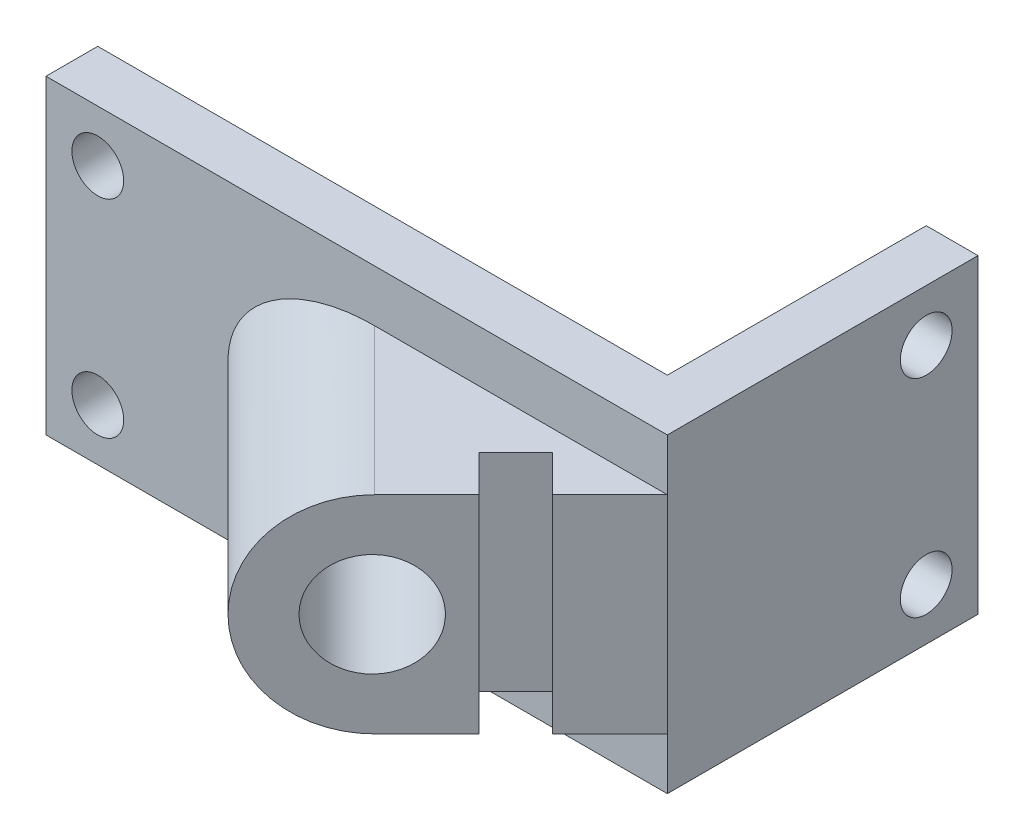
ISO-10303-21;
HEADER;
FILE_DESCRIPTION(('STEP AP214'),'2;1');
FILE_NAME('part.step','',(''),(''),'','','');
FILE_SCHEMA(('AUTOMOTIVE_DESIGN { 1 0 10303 214 1 1 1 1 }'));
ENDSEC;
DATA;
#1=APPLICATION_CONTEXT('core data for automotive mechanical design processes');
#2=APPLICATION_PROTOCOL_DEFINITION('international standard','automotive_design',2000,#1);
#3=PRODUCT_CONTEXT('',#1,'mechanical');
#4=PRODUCT('Part','Part','',(#3));
#5=PRODUCT_RELATED_PRODUCT_CATEGORY('part','',(#4));
#6=PRODUCT_DEFINITION_FORMATION('','',#4);
#7=PRODUCT_DEFINITION_CONTEXT('part definition',#1,'design');
#8=PRODUCT_DEFINITION('design','',#6,#7);
#9=PRODUCT_DEFINITION_SHAPE('','',#8);
#10=(LENGTH_UNIT() NAMED_UNIT(*) SI_UNIT(.MILLI.,.METRE.));
#11=(NAMED_UNIT(*) PLANE_ANGLE_UNIT() SI_UNIT($,.RADIAN.));
#12=(NAMED_UNIT(*) SI_UNIT($,.STERADIAN.) SOLID_ANGLE_UNIT());
#13=UNCERTAINTY_MEASURE_WITH_UNIT(LENGTH_MEASURE(1.E-05),#10,'distance_accuracy_value','');
#14=(GEOMETRIC_REPRESENTATION_CONTEXT(3) GLOBAL_UNCERTAINTY_ASSIGNED_CONTEXT((#13)) GLOBAL_UNIT_ASSIGNED_CONTEXT((#10,
#11,#12)) REPRESENTATION_CONTEXT('',''));
#15=CARTESIAN_POINT('',(0.,0.,0.));
#16=DIRECTION('',(0.,0.,1.));
#17=DIRECTION('',(1.,0.,0.));
#18=AXIS2_PLACEMENT_3D('',#15,#16,#17);
#19=CARTESIAN_POINT('',(-9.99999999999999,0.,-10.));
#20=DIRECTION('',(1.,0.,0.));
#21=DIRECTION('',(0.,0.,-1.));
#22=AXIS2_PLACEMENT_3D('',#19,#20,#21);
#23=PLANE('',#22);
#24=DIRECTION('',(0.,0.,-1.));
#25=VECTOR('',#24,1.);
#26=CARTESIAN_POINT('',(-9.99999999999999,30.,-10.));
#27=LINE('',#26,#25);
#28=CARTESIAN_POINT('',(-9.99999999999999,30.,-10.));
#29=VERTEX_POINT('',#28);
#30=CARTESIAN_POINT('',(-9.99999999999999,30.,-60.));
#31=VERTEX_POINT('',#30);
#32=EDGE_CURVE('E238',#29,#31,#27,.T.);
#33=ORIENTED_EDGE('',*,*,#32,.T.);
#34=DIRECTION('',(0.,1.,0.));
#35=VECTOR('',#34,1.);
#36=CARTESIAN_POINT('',(-9.99999999999999,0.,-60.));
#37=LINE('',#36,#35);
#38=CARTESIAN_POINT('',(-9.99999999999999,-30.,-60.));
#39=VERTEX_POINT('',#38);
#40=EDGE_CURVE('E239',#39,#31,#37,.T.);
#41=ORIENTED_EDGE('',*,*,#40,.F.);
#42=DIRECTION('',(0.,0.,-1.));
#43=VECTOR('',#42,1.);
#44=CARTESIAN_POINT('',(-9.99999999999999,-30.,-10.));
#45=LINE('',#44,#43);
#46=CARTESIAN_POINT('',(-9.99999999999999,-30.,-10.));
#47=VERTEX_POINT('',#46);
#48=EDGE_CURVE('E207',#47,#39,#45,.T.);
#49=ORIENTED_EDGE('',*,*,#48,.F.);
#50=DIRECTION('',(0.,1.,0.));
#51=VECTOR('',#50,1.);
#52=CARTESIAN_POINT('',(-9.99999999999999,0.,-10.));
#53=LINE('',#52,#51);
#54=EDGE_CURVE('E592',#47,#29,#53,.T.);
#55=ORIENTED_EDGE('',*,*,#54,.T.);
#56=EDGE_LOOP('',(#33,#41,#49,#55));
#57=FACE_BOUND('',#56,.T.);
#58=CARTESIAN_POINT('',(-9.99999999999999,-20.,-50.));
#59=DIRECTION('',(1.,0.,0.));
#60=DIRECTION('',(0.,0.,-1.));
#61=AXIS2_PLACEMENT_3D('',#58,#59,#60);
#62=CIRCLE('',#61,5.);
#63=CARTESIAN_POINT('',(-9.99999999999999,-20.,-55.));
#64=VERTEX_POINT('',#63);
#65=EDGE_CURVE('E314',#64,#64,#62,.F.);
#66=ORIENTED_EDGE('',*,*,#65,.F.);
#67=EDGE_LOOP('',(#66));
#68=FACE_BOUND('',#67,.T.);
#69=CARTESIAN_POINT('',(-9.99999999999999,20.,-50.));
#70=DIRECTION('',(1.,0.,0.));
#71=DIRECTION('',(0.,0.,-1.));
#72=AXIS2_PLACEMENT_3D('',#69,#70,#71);
#73=CIRCLE('',#72,5.);
#74=CARTESIAN_POINT('',(-9.99999999999999,20.,-55.));
#75=VERTEX_POINT('',#74);
#76=EDGE_CURVE('E326',#75,#75,#73,.T.);
#77=ORIENTED_EDGE('',*,*,#76,.T.);
#78=EDGE_LOOP('',(#77));
#79=FACE_BOUND('',#78,.T.);
#80=ADVANCED_FACE('F40',(#57,#68,#79),#23,.F.);
#81=CARTESIAN_POINT('',(0.,0.,-60.));
#82=DIRECTION('',(-1.,0.,0.));
#83=DIRECTION('',(0.,0.,1.));
#84=AXIS2_PLACEMENT_3D('',#81,#82,#83);
#85=PLANE('',#84);
#86=DIRECTION('',(0.,0.,1.));
#87=VECTOR('',#86,1.);
#88=CARTESIAN_POINT('',(0.,30.,-60.));
#89=LINE('',#88,#87);
#90=CARTESIAN_POINT('',(0.,30.,-60.));
#91=VERTEX_POINT('',#90);
#92=CARTESIAN_POINT('',(0.,30.,0.));
#93=VERTEX_POINT('',#92);
#94=EDGE_CURVE('E12',#91,#93,#89,.T.);
#95=ORIENTED_EDGE('',*,*,#94,.T.);
#96=DIRECTION('',(0.,1.,0.));
#97=VECTOR('',#96,1.);
#98=CARTESIAN_POINT('',(0.,0.,0.));
#99=LINE('',#98,#97);
#100=CARTESIAN_POINT('',(0.,20.,0.));
#101=VERTEX_POINT('',#100);
#102=EDGE_CURVE('E243',#101,#93,#99,.T.);
#103=ORIENTED_EDGE('',*,*,#102,.F.);
#104=DIRECTION('',(0.,1.,0.));
#105=VECTOR('',#104,1.);
#106=CARTESIAN_POINT('',(0.,20.,0.));
#107=LINE('',#106,#105);
#108=CARTESIAN_POINT('',(0.,-20.,0.));
#109=VERTEX_POINT('',#108);
#110=EDGE_CURVE('E189',#109,#101,#107,.T.);
#111=ORIENTED_EDGE('',*,*,#110,.F.);
#112=CARTESIAN_POINT('',(0.,-30.,0.));
#113=VERTEX_POINT('',#112);
#114=EDGE_CURVE('E50',#113,#109,#99,.T.);
#115=ORIENTED_EDGE('',*,*,#114,.F.);
#116=DIRECTION('',(0.,0.,1.));
#117=VECTOR('',#116,1.);
#118=CARTESIAN_POINT('',(0.,-30.,-60.));
#119=LINE('',#118,#117);
#120=CARTESIAN_POINT('',(0.,-30.,-60.));
#121=VERTEX_POINT('',#120);
#122=EDGE_CURVE('E210',#121,#113,#119,.T.);
#123=ORIENTED_EDGE('',*,*,#122,.F.);
#124=DIRECTION('',(0.,1.,0.));
#125=VECTOR('',#124,1.);
#126=CARTESIAN_POINT('',(0.,0.,-60.));
#127=LINE('',#126,#125);
#128=EDGE_CURVE('E235',#121,#91,#127,.T.);
#129=ORIENTED_EDGE('',*,*,#128,.T.);
#130=EDGE_LOOP('',(#95,#103,#111,#115,#123,#129));
#131=FACE_BOUND('',#130,.T.);
#132=CARTESIAN_POINT('',(0.,-20.,-50.));
#133=DIRECTION('',(-1.,0.,0.));
#134=DIRECTION('',(0.,0.,-1.));
#135=AXIS2_PLACEMENT_3D('',#132,#133,#134);
#136=CIRCLE('',#135,5.);
#137=CARTESIAN_POINT('',(0.,-20.,-55.));
#138=VERTEX_POINT('',#137);
#139=EDGE_CURVE('E317',#138,#138,#136,.T.);
#140=ORIENTED_EDGE('',*,*,#139,.T.);
#141=EDGE_LOOP('',(#140));
#142=FACE_BOUND('',#141,.T.);
#143=CARTESIAN_POINT('',(0.,20.,-50.));
#144=DIRECTION('',(1.,0.,0.));
#145=DIRECTION('',(0.,0.,-1.));
#146=AXIS2_PLACEMENT_3D('',#143,#144,#145);
#147=CIRCLE('',#146,5.);
#148=CARTESIAN_POINT('',(0.,20.,-55.));
#149=VERTEX_POINT('',#148);
#150=EDGE_CURVE('E329',#149,#149,#147,.T.);
#151=ORIENTED_EDGE('',*,*,#150,.F.);
#152=EDGE_LOOP('',(#151));
#153=FACE_BOUND('',#152,.T.);
#154=ADVANCED_FACE('F266',(#131,#142,#153),#85,.F.);
#155=CARTESIAN_POINT('',(0.,0.,0.));
#156=DIRECTION('',(0.,0.,-1.));
#157=DIRECTION('',(-1.,0.,0.));
#158=AXIS2_PLACEMENT_3D('',#155,#156,#157);
#159=PLANE('',#158);
#160=DIRECTION('',(1.,0.,0.));
#161=VECTOR('',#160,1.);
#162=CARTESIAN_POINT('',(0.,-20.,0.));
#163=LINE('',#162,#161);
#164=CARTESIAN_POINT('',(-56.5685424949238,-20.,0.));
#165=VERTEX_POINT('',#164);
#166=EDGE_CURVE('E66',#165,#109,#163,.T.);
#167=ORIENTED_EDGE('',*,*,#166,.F.);
#168=CARTESIAN_POINT('',(-56.5685424949238,0.,0.));
#169=DIRECTION('',(0.,0.,-1.));
#170=DIRECTION('',(-1.,0.,0.));
#171=AXIS2_PLACEMENT_3D('',#168,#169,#170);
#172=ELLIPSE('',#171,28.2842712474619,20.);
#173=CARTESIAN_POINT('',(-56.5685424949238,20.,0.));
#174=VERTEX_POINT('',#173);
#175=EDGE_CURVE('E180',#174,#165,#172,.F.);
#176=ORIENTED_EDGE('',*,*,#175,.F.);
#177=DIRECTION('',(-1.,0.,0.));
#178=VECTOR('',#177,1.);
#179=CARTESIAN_POINT('',(-28.2842712474619,20.,0.));
#180=LINE('',#179,#178);
#181=EDGE_CURVE('E186',#101,#174,#180,.T.);
#182=ORIENTED_EDGE('',*,*,#181,.F.);
#183=ORIENTED_EDGE('',*,*,#102,.T.);
#184=DIRECTION('',(-1.,0.,0.));
#185=VECTOR('',#184,1.);
#186=CARTESIAN_POINT('',(0.,30.,0.));
#187=LINE('',#186,#185);
#188=CARTESIAN_POINT('',(-120.,30.,0.));
#189=VERTEX_POINT('',#188);
#190=EDGE_CURVE('E250',#93,#189,#187,.T.);
#191=ORIENTED_EDGE('',*,*,#190,.T.);
#192=DIRECTION('',(0.,1.,0.));
#193=VECTOR('',#192,1.);
#194=CARTESIAN_POINT('',(-120.,0.,0.));
#195=LINE('',#194,#193);
#196=CARTESIAN_POINT('',(-120.,-30.,0.));
#197=VERTEX_POINT('',#196);
#198=EDGE_CURVE('E572',#197,#189,#195,.T.);
#199=ORIENTED_EDGE('',*,*,#198,.F.);
#200=DIRECTION('',(-1.,0.,0.));
#201=VECTOR('',#200,1.);
#202=CARTESIAN_POINT('',(0.,-30.,0.));
#203=LINE('',#202,#201);
#204=EDGE_CURVE('E214',#113,#197,#203,.T.);
#205=ORIENTED_EDGE('',*,*,#204,.F.);
#206=ORIENTED_EDGE('',*,*,#114,.T.);
#207=EDGE_LOOP('',(#167,#176,#182,#183,#191,#199,#205,#206));
#208=FACE_BOUND('',#207,.T.);
#209=CARTESIAN_POINT('',(-110.,-20.,0.));
#210=DIRECTION('',(0.,0.,-1.));
#211=DIRECTION('',(1.,0.,0.));
#212=AXIS2_PLACEMENT_3D('',#209,#210,#211);
#213=CIRCLE('',#212,5.);
#214=CARTESIAN_POINT('',(-105.,-20.,0.));
#215=VERTEX_POINT('',#214);
#216=EDGE_CURVE('E311',#215,#215,#213,.T.);
#217=ORIENTED_EDGE('',*,*,#216,.T.);
#218=EDGE_LOOP('',(#217));
#219=FACE_BOUND('',#218,.T.);
#220=CARTESIAN_POINT('',(-110.,20.,0.));
#221=DIRECTION('',(0.,0.,1.));
#222=DIRECTION('',(1.,0.,0.));
#223=AXIS2_PLACEMENT_3D('',#220,#221,#222);
#224=CIRCLE('',#223,5.);
#225=CARTESIAN_POINT('',(-105.,20.,0.));
#226=VERTEX_POINT('',#225);
#227=EDGE_CURVE('E323',#226,#226,#224,.T.);
#228=ORIENTED_EDGE('',*,*,#227,.F.);
#229=EDGE_LOOP('',(#228));
#230=FACE_BOUND('',#229,.T.);
#231=ADVANCED_FACE('F262',(#208,#219,#230),#159,.F.);
#232=CARTESIAN_POINT('',(-120.,0.,-10.));
#233=DIRECTION('',(0.,0.,1.));
#234=DIRECTION('',(1.,0.,0.));
#235=AXIS2_PLACEMENT_3D('',#232,#233,#234);
#236=PLANE('',#235);
#237=DIRECTION('',(1.,0.,0.));
#238=VECTOR('',#237,1.);
#239=CARTESIAN_POINT('',(-120.,30.,-10.));
#240=LINE('',#239,#238);
#241=CARTESIAN_POINT('',(-120.,30.,-10.));
#242=VERTEX_POINT('',#241);
#243=EDGE_CURVE('E588',#242,#29,#240,.T.);
#244=ORIENTED_EDGE('',*,*,#243,.T.);
#245=ORIENTED_EDGE('',*,*,#54,.F.);
#246=DIRECTION('',(1.,0.,0.));
#247=VECTOR('',#246,1.);
#248=CARTESIAN_POINT('',(-120.,-30.,-10.));
#249=LINE('',#248,#247);
#250=CARTESIAN_POINT('',(-120.,-30.,-10.));
#251=VERTEX_POINT('',#250);
#252=EDGE_CURVE('E224',#251,#47,#249,.T.);
#253=ORIENTED_EDGE('',*,*,#252,.F.);
#254=DIRECTION('',(0.,1.,0.));
#255=VECTOR('',#254,1.);
#256=CARTESIAN_POINT('',(-120.,0.,-10.));
#257=LINE('',#256,#255);
#258=EDGE_CURVE('E583',#251,#242,#257,.T.);
#259=ORIENTED_EDGE('',*,*,#258,.T.);
#260=EDGE_LOOP('',(#244,#245,#253,#259));
#261=FACE_BOUND('',#260,.T.);
#262=CARTESIAN_POINT('',(-110.,-20.,-10.));
#263=DIRECTION('',(0.,0.,1.));
#264=DIRECTION('',(1.,0.,0.));
#265=AXIS2_PLACEMENT_3D('',#262,#263,#264);
#266=CIRCLE('',#265,5.);
#267=CARTESIAN_POINT('',(-105.,-20.,-10.));
#268=VERTEX_POINT('',#267);
#269=EDGE_CURVE('E279',#268,#268,#266,.F.);
#270=ORIENTED_EDGE('',*,*,#269,.F.);
#271=EDGE_LOOP('',(#270));
#272=FACE_BOUND('',#271,.T.);
#273=CARTESIAN_POINT('',(-110.,20.,-10.));
#274=DIRECTION('',(0.,0.,1.));
#275=DIRECTION('',(1.,0.,0.));
#276=AXIS2_PLACEMENT_3D('',#273,#274,#275);
#277=CIRCLE('',#276,5.);
#278=CARTESIAN_POINT('',(-105.,20.,-10.));
#279=VERTEX_POINT('',#278);
#280=EDGE_CURVE('E320',#279,#279,#277,.T.);
#281=ORIENTED_EDGE('',*,*,#280,.T.);
#282=EDGE_LOOP('',(#281));
#283=FACE_BOUND('',#282,.T.);
#284=ADVANCED_FACE('F340',(#261,#272,#283),#236,.F.);
#285=CARTESIAN_POINT('',(0.,-20.,0.));
#286=DIRECTION('',(0.,-1.,0.));
#287=DIRECTION('',(0.,0.,-1.));
#288=AXIS2_PLACEMENT_3D('',#285,#286,#287);
#289=PLANE('',#288);
#290=DIRECTION('',(0.707106781186548,0.,-0.707106781186547));
#291=VECTOR('',#290,1.);
#292=CARTESIAN_POINT('',(-25.2400790203404,-20.,11.0979433966095));
#293=LINE('',#292,#291);
#294=CARTESIAN_POINT('',(-25.2400790203404,-20.,11.0979433966095));
#295=VERTEX_POINT('',#294);
#296=CARTESIAN_POINT('',(-18.169011208475,-20.,4.02687558474399));
#297=VERTEX_POINT('',#296);
#298=EDGE_CURVE('E150',#295,#297,#293,.T.);
#299=ORIENTED_EDGE('',*,*,#298,.F.);
#300=DIRECTION('',(-0.707106781186547,0.,-0.707106781186548));
#301=VECTOR('',#300,1.);
#302=CARTESIAN_POINT('',(-18.169011208475,-20.,18.1690112084749));
#303=LINE('',#302,#301);
#304=CARTESIAN_POINT('',(-18.169011208475,-20.,18.1690112084749));
#305=VERTEX_POINT('',#304);
#306=EDGE_CURVE('E143',#305,#295,#303,.T.);
#307=ORIENTED_EDGE('',*,*,#306,.F.);
#308=DIRECTION('',(-0.707106781186548,0.,0.707106781186547));
#309=VECTOR('',#308,1.);
#310=CARTESIAN_POINT('',(0.,-20.,0.));
#311=LINE('',#310,#309);
#312=CARTESIAN_POINT('',(-28.2842712474619,-20.,28.2842712474619));
#313=VERTEX_POINT('',#312);
#314=EDGE_CURVE('E44',#305,#313,#311,.T.);
#315=ORIENTED_EDGE('',*,*,#314,.T.);
#316=DIRECTION('',(-0.707106781186548,0.,-0.707106781186548));
#317=VECTOR('',#316,1.);
#318=CARTESIAN_POINT('',(-28.2842712474619,-20.,28.2842712474619));
#319=LINE('',#318,#317);
#320=EDGE_CURVE('E166',#313,#165,#319,.T.);
#321=ORIENTED_EDGE('',*,*,#320,.T.);
#322=ORIENTED_EDGE('',*,*,#166,.T.);
#323=CARTESIAN_POINT('',(-11.0979433966095,-20.,11.0979433966095));
#324=VERTEX_POINT('',#323);
#325=EDGE_CURVE('E162',#109,#324,#311,.T.);
#326=ORIENTED_EDGE('',*,*,#325,.T.);
#327=DIRECTION('',(0.707106781186547,0.,0.707106781186548));
#328=VECTOR('',#327,1.);
#329=CARTESIAN_POINT('',(-18.169011208475,-20.,4.02687558474399));
#330=LINE('',#329,#328);
#331=EDGE_CURVE('E58',#297,#324,#330,.T.);
#332=ORIENTED_EDGE('',*,*,#331,.F.);
#333=EDGE_LOOP('',(#299,#307,#315,#321,#322,#326,#332));
#334=FACE_BOUND('',#333,.T.);
#335=ADVANCED_FACE('F153',(#334),#289,.T.);
#336=CARTESIAN_POINT('',(-28.2842712474619,20.,28.2842712474619));
#337=DIRECTION('',(0.,1.,0.));
#338=DIRECTION('',(0.,0.,1.));
#339=AXIS2_PLACEMENT_3D('',#336,#337,#338);
#340=PLANE('',#339);
#341=DIRECTION('',(0.707106781186548,0.,-0.707106781186547));
#342=VECTOR('',#341,1.);
#343=CARTESIAN_POINT('',(-28.2842712474619,20.,28.2842712474619));
#344=LINE('',#343,#342);
#345=CARTESIAN_POINT('',(-28.2842712474619,20.,28.2842712474619));
#346=VERTEX_POINT('',#345);
#347=CARTESIAN_POINT('',(-18.169011208475,20.,18.1690112084749));
#348=VERTEX_POINT('',#347);
#349=EDGE_CURVE('E190',#346,#348,#344,.T.);
#350=ORIENTED_EDGE('',*,*,#349,.T.);
#351=DIRECTION('',(-0.707106781186547,0.,-0.707106781186548));
#352=VECTOR('',#351,1.);
#353=CARTESIAN_POINT('',(-18.169011208475,20.,18.1690112084749));
#354=LINE('',#353,#352);
#355=CARTESIAN_POINT('',(-25.2400790203404,20.,11.0979433966095));
#356=VERTEX_POINT('',#355);
#357=EDGE_CURVE('E146',#348,#356,#354,.T.);
#358=ORIENTED_EDGE('',*,*,#357,.T.);
#359=DIRECTION('',(0.707106781186548,0.,-0.707106781186547));
#360=VECTOR('',#359,1.);
#361=CARTESIAN_POINT('',(-25.2400790203404,20.,11.0979433966095));
#362=LINE('',#361,#360);
#363=CARTESIAN_POINT('',(-18.169011208475,20.,4.02687558474399));
#364=VERTEX_POINT('',#363);
#365=EDGE_CURVE('E304',#356,#364,#362,.T.);
#366=ORIENTED_EDGE('',*,*,#365,.T.);
#367=DIRECTION('',(0.707106781186547,0.,0.707106781186548));
#368=VECTOR('',#367,1.);
#369=CARTESIAN_POINT('',(-18.169011208475,20.,4.02687558474399));
#370=LINE('',#369,#368);
#371=CARTESIAN_POINT('',(-11.0979433966095,20.,11.0979433966095));
#372=VERTEX_POINT('',#371);
#373=EDGE_CURVE('E301',#364,#372,#370,.T.);
#374=ORIENTED_EDGE('',*,*,#373,.T.);
#375=EDGE_CURVE('E199',#372,#101,#344,.T.);
#376=ORIENTED_EDGE('',*,*,#375,.T.);
#377=ORIENTED_EDGE('',*,*,#181,.T.);
#378=DIRECTION('',(-0.707106781186548,0.,-0.707106781186548));
#379=VECTOR('',#378,1.);
#380=CARTESIAN_POINT('',(-28.2842712474619,20.,28.2842712474619));
#381=LINE('',#380,#379);
#382=EDGE_CURVE('E164',#346,#174,#381,.T.);
#383=ORIENTED_EDGE('',*,*,#382,.F.);
#384=EDGE_LOOP('',(#350,#358,#366,#374,#376,#377,#383));
#385=FACE_BOUND('',#384,.T.);
#386=ADVANCED_FACE('F258',(#385),#340,.T.);
#387=CARTESIAN_POINT('',(24.2776034554449,11.0379206416529,-24.2776034554449));
#388=DIRECTION('',(0.707106781186548,0.,0.707106781186547));
#389=DIRECTION('',(0.707106781186547,0.,-0.707106781186548));
#390=AXIS2_PLACEMENT_3D('',#387,#388,#389);
#391=PLANE('',#390);
#392=CARTESIAN_POINT('',(-28.5,0.,28.5));
#393=DIRECTION('',(-0.707106781186547,0.,-0.707106781186547));
#394=DIRECTION('',(0.707106781186548,0.,-0.707106781186548));
#395=AXIS2_PLACEMENT_3D('',#392,#393,#394);
#396=CIRCLE('',#395,10.);
#397=CARTESIAN_POINT('',(-35.5710678118655,0.,35.5710678118655));
#398=VERTEX_POINT('',#397);
#399=EDGE_CURVE('E168',#398,#398,#396,.T.);
#400=ORIENTED_EDGE('',*,*,#399,.T.);
#401=EDGE_LOOP('',(#400));
#402=FACE_BOUND('',#401,.T.);
#403=ORIENTED_EDGE('',*,*,#314,.F.);
#404=DIRECTION('',(0.,1.,0.));
#405=VECTOR('',#404,1.);
#406=CARTESIAN_POINT('',(-18.169011208475,-20.,18.1690112084749));
#407=LINE('',#406,#405);
#408=EDGE_CURVE('E139',#305,#348,#407,.T.);
#409=ORIENTED_EDGE('',*,*,#408,.T.);
#410=ORIENTED_EDGE('',*,*,#349,.F.);
#411=CARTESIAN_POINT('',(-28.2842712474619,0.,28.2842712474619));
#412=DIRECTION('',(-0.707106781186547,0.,-0.707106781186548));
#413=DIRECTION('',(-0.707106781186548,0.,0.707106781186547));
#414=AXIS2_PLACEMENT_3D('',#411,#412,#413);
#415=CIRCLE('',#414,20.);
#416=EDGE_CURVE('E160',#313,#346,#415,.T.);
#417=ORIENTED_EDGE('',*,*,#416,.F.);
#418=EDGE_LOOP('',(#403,#409,#410,#417));
#419=FACE_BOUND('',#418,.T.);
#420=ADVANCED_FACE('F158',(#402,#419),#391,.T.);
#421=ORIENTED_EDGE('',*,*,#375,.F.);
#422=DIRECTION('',(0.,1.,0.));
#423=VECTOR('',#422,1.);
#424=CARTESIAN_POINT('',(-11.0979433966095,-20.,11.0979433966095));
#425=LINE('',#424,#423);
#426=EDGE_CURVE('E273',#324,#372,#425,.T.);
#427=ORIENTED_EDGE('',*,*,#426,.F.);
#428=ORIENTED_EDGE('',*,*,#325,.F.);
#429=ORIENTED_EDGE('',*,*,#110,.T.);
#430=EDGE_LOOP('',(#421,#427,#428,#429));
#431=FACE_BOUND('',#430,.T.);
#432=ADVANCED_FACE('F272',(#431),#391,.T.);
#433=CARTESIAN_POINT('',(-172.530372145868,30.,-8.22494854300934));
#434=DIRECTION('',(0.,1.,0.));
#435=DIRECTION('',(0.,0.,1.));
#436=AXIS2_PLACEMENT_3D('',#433,#434,#435);
#437=PLANE('',#436);
#438=ORIENTED_EDGE('',*,*,#94,.F.);
#439=DIRECTION('',(1.,0.,0.));
#440=VECTOR('',#439,1.);
#441=CARTESIAN_POINT('',(-9.99999999999999,30.,-60.));
#442=LINE('',#441,#440);
#443=EDGE_CURVE('E213',#31,#91,#442,.T.);
#444=ORIENTED_EDGE('',*,*,#443,.F.);
#445=ORIENTED_EDGE('',*,*,#32,.F.);
#446=ORIENTED_EDGE('',*,*,#243,.F.);
#447=DIRECTION('',(0.,0.,-1.));
#448=VECTOR('',#447,1.);
#449=CARTESIAN_POINT('',(-120.,30.,0.));
#450=LINE('',#449,#448);
#451=EDGE_CURVE('E570',#189,#242,#450,.T.);
#452=ORIENTED_EDGE('',*,*,#451,.F.);
#453=ORIENTED_EDGE('',*,*,#190,.F.);
#454=EDGE_LOOP('',(#438,#444,#445,#446,#452,#453));
#455=FACE_BOUND('',#454,.T.);
#456=ADVANCED_FACE('F42',(#455),#437,.T.);
#457=CARTESIAN_POINT('',(-9.99999999999999,0.,-60.));
#458=DIRECTION('',(0.,0.,1.));
#459=DIRECTION('',(1.,0.,0.));
#460=AXIS2_PLACEMENT_3D('',#457,#458,#459);
#461=PLANE('',#460);
#462=ORIENTED_EDGE('',*,*,#443,.T.);
#463=ORIENTED_EDGE('',*,*,#128,.F.);
#464=DIRECTION('',(1.,0.,0.));
#465=VECTOR('',#464,1.);
#466=CARTESIAN_POINT('',(-9.99999999999999,-30.,-60.));
#467=LINE('',#466,#465);
#468=EDGE_CURVE('E193',#39,#121,#467,.T.);
#469=ORIENTED_EDGE('',*,*,#468,.F.);
#470=ORIENTED_EDGE('',*,*,#40,.T.);
#471=EDGE_LOOP('',(#462,#463,#469,#470));
#472=FACE_BOUND('',#471,.T.);
#473=ADVANCED_FACE('F349',(#472),#461,.F.);
#474=CARTESIAN_POINT('',(-120.,0.,0.));
#475=DIRECTION('',(1.,0.,0.));
#476=DIRECTION('',(0.,0.,-1.));
#477=AXIS2_PLACEMENT_3D('',#474,#475,#476);
#478=PLANE('',#477);
#479=ORIENTED_EDGE('',*,*,#451,.T.);
#480=ORIENTED_EDGE('',*,*,#258,.F.);
#481=DIRECTION('',(0.,0.,-1.));
#482=VECTOR('',#481,1.);
#483=CARTESIAN_POINT('',(-120.,-30.,0.));
#484=LINE('',#483,#482);
#485=EDGE_CURVE('E219',#197,#251,#484,.T.);
#486=ORIENTED_EDGE('',*,*,#485,.F.);
#487=ORIENTED_EDGE('',*,*,#198,.T.);
#488=EDGE_LOOP('',(#479,#480,#486,#487));
#489=FACE_BOUND('',#488,.T.);
#490=ADVANCED_FACE('F345',(#489),#478,.F.);
#491=CARTESIAN_POINT('',(-172.530372145868,-30.,-8.22494854300934));
#492=DIRECTION('',(0.,1.,0.));
#493=DIRECTION('',(0.,0.,1.));
#494=AXIS2_PLACEMENT_3D('',#491,#492,#493);
#495=PLANE('',#494);
#496=ORIENTED_EDGE('',*,*,#122,.T.);
#497=ORIENTED_EDGE('',*,*,#204,.T.);
#498=ORIENTED_EDGE('',*,*,#485,.T.);
#499=ORIENTED_EDGE('',*,*,#252,.T.);
#500=ORIENTED_EDGE('',*,*,#48,.T.);
#501=ORIENTED_EDGE('',*,*,#468,.T.);
#502=EDGE_LOOP('',(#496,#497,#498,#499,#500,#501));
#503=FACE_BOUND('',#502,.T.);
#504=ADVANCED_FACE('F348',(#503),#495,.F.);
#505=CARTESIAN_POINT('',(-28.2842712474619,0.,28.2842712474619));
#506=DIRECTION('',(-0.707106781186548,0.,-0.707106781186548));
#507=DIRECTION('',(-0.707106781186548,0.,0.707106781186547));
#508=AXIS2_PLACEMENT_3D('',#505,#506,#507);
#509=CYLINDRICAL_SURFACE('',#508,20.);
#510=ORIENTED_EDGE('',*,*,#382,.T.);
#511=ORIENTED_EDGE('',*,*,#175,.T.);
#512=ORIENTED_EDGE('',*,*,#320,.F.);
#513=ORIENTED_EDGE('',*,*,#416,.T.);
#514=EDGE_LOOP('',(#510,#511,#512,#513));
#515=FACE_BOUND('',#514,.T.);
#516=ADVANCED_FACE('F261',(#515),#509,.T.);
#517=CARTESIAN_POINT('',(-32.8912573075883,5.79741731306034,-23.6772852173646));
#518=DIRECTION('',(0.7071067816309,0.,0.707106780742195));
#519=DIRECTION('',(0.707106780742195,0.,-0.7071067816309));
#520=AXIS2_PLACEMENT_3D('',#517,#518,#519);
#521=PLANE('',#520);
#522=CARTESIAN_POINT('',(-56.7842712474619,0.,0.215728752538086));
#523=DIRECTION('',(-0.707106781186547,0.,-0.707106781186547));
#524=DIRECTION('',(0.707106781186548,0.,-0.707106781186548));
#525=AXIS2_PLACEMENT_3D('',#522,#523,#524);
#526=CIRCLE('',#525,10.);
#527=CARTESIAN_POINT('',(-63.8553390593274,0.,7.28679656440356));
#528=VERTEX_POINT('',#527);
#529=EDGE_CURVE('E173',#528,#528,#526,.T.);
#530=ORIENTED_EDGE('',*,*,#529,.F.);
#531=EDGE_LOOP('',(#530));
#532=FACE_BOUND('',#531,.T.);
#533=ADVANCED_FACE('F364',(#532),#521,.T.);
#534=CARTESIAN_POINT('',(-28.5,0.,28.5));
#535=DIRECTION('',(-0.707106781186547,0.,-0.707106781186548));
#536=DIRECTION('',(-0.707106781186548,0.,0.707106781186547));
#537=AXIS2_PLACEMENT_3D('',#534,#535,#536);
#538=CYLINDRICAL_SURFACE('',#537,10.);
#539=CARTESIAN_POINT('',(-63.8553390593274,0.,7.28679656440356));
#540=CARTESIAN_POINT('',(-63.560711233833,0.,7.58142438989796));
#541=CARTESIAN_POINT('',(-63.2660834083386,0.,7.87605221539236));
#542=CARTESIAN_POINT('',(-62.6768277573498,0.,8.46530786638114));
#543=CARTESIAN_POINT('',(-62.3821999318554,0.,8.75993569187554));
#544=CARTESIAN_POINT('',(-61.7929442808666,0.,9.34919134286433));
#545=CARTESIAN_POINT('',(-61.4983164553722,0.,9.64381916835872));
#546=CARTESIAN_POINT('',(-60.9090608043834,0.,10.2330748193475));
#547=CARTESIAN_POINT('',(-60.614432978889,0.,10.5277026448419));
#548=CARTESIAN_POINT('',(-60.0251773279002,0.,11.1169582958307));
#549=CARTESIAN_POINT('',(-59.7305495024059,0.,11.4115861213251));
#550=CARTESIAN_POINT('',(-59.1412938514171,0.,12.0008417723139));
#551=CARTESIAN_POINT('',(-58.8466660259227,0.,12.2954695978083));
#552=CARTESIAN_POINT('',(-58.2574103749339,0.,12.8847252487971));
#553=CARTESIAN_POINT('',(-57.9627825494395,0.,13.1793530742915));
#554=CARTESIAN_POINT('',(-57.3735268984507,0.,13.7686087252802));
#555=CARTESIAN_POINT('',(-57.0788990729563,0.,14.0632365507746));
#556=CARTESIAN_POINT('',(-56.4896434219675,0.,14.6524922017634));
#557=CARTESIAN_POINT('',(-56.1950155964731,0.,14.9471200272578));
#558=CARTESIAN_POINT('',(-55.6057599454843,0.,15.5363756782466));
#559=CARTESIAN_POINT('',(-55.3111321199899,0.,15.831003503741));
#560=CARTESIAN_POINT('',(-54.7218764690011,0.,16.4202591547298));
#561=CARTESIAN_POINT('',(-54.4272486435067,0.,16.7148869802242));
#562=CARTESIAN_POINT('',(-53.837992992518,0.,17.304142631213));
#563=CARTESIAN_POINT('',(-53.5433651670236,0.,17.5987704567074));
#564=CARTESIAN_POINT('',(-52.9541095160348,0.,18.1880261076962));
#565=CARTESIAN_POINT('',(-52.6594816905404,0.,18.4826539331906));
#566=CARTESIAN_POINT('',(-52.0702260395516,0.,19.0719095841794));
#567=CARTESIAN_POINT('',(-51.7755982140572,0.,19.3665374096738));
#568=CARTESIAN_POINT('',(-51.1863425630684,0.,19.9557930606625));
#569=CARTESIAN_POINT('',(-50.891714737574,0.,20.2504208861569));
#570=CARTESIAN_POINT('',(-50.3024590865852,0.,20.8396765371457));
#571=CARTESIAN_POINT('',(-50.0078312610908,0.,21.1343043626401));
#572=CARTESIAN_POINT('',(-49.418575610102,0.,21.7235600136289));
#573=CARTESIAN_POINT('',(-49.1239477846076,0.,22.0181878391233));
#574=CARTESIAN_POINT('',(-48.5346921336188,0.,22.6074434901121));
#575=CARTESIAN_POINT('',(-48.2400643081244,0.,22.9020713156065));
#576=CARTESIAN_POINT('',(-47.6508086571357,0.,23.4913269665953));
#577=CARTESIAN_POINT('',(-47.3561808316413,0.,23.7859547920897));
#578=CARTESIAN_POINT('',(-46.7669251806525,0.,24.3752104430785));
#579=CARTESIAN_POINT('',(-46.4722973551581,0.,24.6698382685729));
#580=CARTESIAN_POINT('',(-45.8830417041693,0.,25.2590939195616));
#581=CARTESIAN_POINT('',(-45.5884138786749,0.,25.553721745056));
#582=CARTESIAN_POINT('',(-44.9991582276861,0.,26.1429773960448));
#583=CARTESIAN_POINT('',(-44.7045304021917,0.,26.4376052215392));
#584=CARTESIAN_POINT('',(-44.1152747512029,0.,27.026860872528));
#585=CARTESIAN_POINT('',(-43.8206469257085,0.,27.3214886980224));
#586=CARTESIAN_POINT('',(-43.2313912747197,0.,27.9107443490112));
#587=CARTESIAN_POINT('',(-42.9367634492253,0.,28.2053721745056));
#588=CARTESIAN_POINT('',(-42.3475077982366,0.,28.7946278254944));
#589=CARTESIAN_POINT('',(-42.0528799727422,0.,29.0892556509888));
#590=CARTESIAN_POINT('',(-41.4636243217534,0.,29.6785113019776));
#591=CARTESIAN_POINT('',(-41.168996496259,0.,29.973139127472));
#592=CARTESIAN_POINT('',(-40.5797408452702,0.,30.5623947784608));
#593=CARTESIAN_POINT('',(-40.2851130197758,0.,30.8570226039552));
#594=CARTESIAN_POINT('',(-39.695857368787,0.,31.4462782549439));
#595=CARTESIAN_POINT('',(-39.4012295432926,0.,31.7409060804383));
#596=CARTESIAN_POINT('',(-38.8119738923038,0.,32.3301617314271));
#597=CARTESIAN_POINT('',(-38.5173460668094,0.,32.6247895569215));
#598=CARTESIAN_POINT('',(-37.9280904158206,0.,33.2140452079103));
#599=CARTESIAN_POINT('',(-37.6334625903262,0.,33.5086730334047));
#600=CARTESIAN_POINT('',(-37.0442069393374,0.,34.0979286843935));
#601=CARTESIAN_POINT('',(-36.7495791138431,0.,34.3925565098879));
#602=CARTESIAN_POINT('',(-36.1603234628543,0.,34.9818121608767));
#603=CARTESIAN_POINT('',(-35.8656956373599,0.,35.2764399863711));
#604=CARTESIAN_POINT('',(-35.5710678118655,0.,35.5710678118655));
#605=B_SPLINE_CURVE_WITH_KNOTS('',3,(#539,#540,#541,#542,#543,#544,#545,#546,#547,#548,#549,
#550,#551,#552,#553,#554,#555,#556,#557,#558,#559,#560,#561,#562,#563,#564,#565,#566,#567,#568,
#569,#570,#571,#572,#573,#574,#575,#576,#577,#578,#579,#580,#581,#582,#583,#584,#585,#586,#587,
#588,#589,#590,#591,#592,#593,#594,#595,#596,#597,#598,#599,#600,#601,#602,#603,#604),
.UNSPECIFIED.,.F.,.F.,(4,2,2,2,2,2,2,2,2,2,2,2,2,2,2,2,2,2,2,2,2,2,2,2,2,2,2,2,2,2,2,2,4),(0.,
1.24999999999999,2.5,3.75,4.99999999999999,6.24999999999999,7.49999999999999,8.75,10.,11.25,
12.5,13.75,15.,16.25,17.5,18.75,20.,21.25,22.5,23.75,25.,26.25,27.5,28.75,30.,31.25,32.5,33.75,
35.,36.25,37.5,38.75,40.),.UNSPECIFIED.);
#606=EDGE_CURVE('BSEAM365',#528,#398,#605,.T.);
#607=ORIENTED_EDGE('',*,*,#529,.T.);
#608=ORIENTED_EDGE('',*,*,#399,.F.);
#609=ORIENTED_EDGE('',*,*,#606,.T.);
#610=ORIENTED_EDGE('',*,*,#606,.F.);
#611=EDGE_LOOP('',(#607,#609,#608,#610));
#612=FACE_BOUND('',#611,.T.);
#613=ADVANCED_FACE('F365',(#612),#538,.F.);
#614=CARTESIAN_POINT('',(-18.169011208475,-20.,18.1690112084749));
#615=DIRECTION('',(0.707106781186548,0.,-0.707106781186547));
#616=DIRECTION('',(-0.707106781186547,0.,-0.707106781186548));
#617=AXIS2_PLACEMENT_3D('',#614,#615,#616);
#618=PLANE('',#617);
#619=ORIENTED_EDGE('',*,*,#408,.F.);
#620=ORIENTED_EDGE('',*,*,#306,.T.);
#621=DIRECTION('',(0.,1.,0.));
#622=VECTOR('',#621,1.);
#623=CARTESIAN_POINT('',(-25.2400790203404,-20.,11.0979433966095));
#624=LINE('',#623,#622);
#625=EDGE_CURVE('E276',#295,#356,#624,.T.);
#626=ORIENTED_EDGE('',*,*,#625,.T.);
#627=ORIENTED_EDGE('',*,*,#357,.F.);
#628=EDGE_LOOP('',(#619,#620,#626,#627));
#629=FACE_BOUND('',#628,.T.);
#630=ADVANCED_FACE('F141',(#629),#618,.T.);
#631=CARTESIAN_POINT('',(-25.2400790203404,-20.,11.0979433966095));
#632=DIRECTION('',(0.707106781186547,0.,0.707106781186548));
#633=DIRECTION('',(0.707106781186548,0.,-0.707106781186547));
#634=AXIS2_PLACEMENT_3D('',#631,#632,#633);
#635=PLANE('',#634);
#636=ORIENTED_EDGE('',*,*,#625,.F.);
#637=ORIENTED_EDGE('',*,*,#298,.T.);
#638=DIRECTION('',(0.,1.,0.));
#639=VECTOR('',#638,1.);
#640=CARTESIAN_POINT('',(-18.169011208475,-20.,4.02687558474399));
#641=LINE('',#640,#639);
#642=EDGE_CURVE('E274',#297,#364,#641,.T.);
#643=ORIENTED_EDGE('',*,*,#642,.T.);
#644=ORIENTED_EDGE('',*,*,#365,.F.);
#645=EDGE_LOOP('',(#636,#637,#643,#644));
#646=FACE_BOUND('',#645,.T.);
#647=ADVANCED_FACE('F377',(#646),#635,.T.);
#648=CARTESIAN_POINT('',(-18.169011208475,-20.,4.02687558474399));
#649=DIRECTION('',(-0.707106781186548,0.,0.707106781186547));
#650=DIRECTION('',(0.707106781186547,0.,0.707106781186548));
#651=AXIS2_PLACEMENT_3D('',#648,#649,#650);
#652=PLANE('',#651);
#653=ORIENTED_EDGE('',*,*,#642,.F.);
#654=ORIENTED_EDGE('',*,*,#331,.T.);
#655=ORIENTED_EDGE('',*,*,#426,.T.);
#656=ORIENTED_EDGE('',*,*,#373,.F.);
#657=EDGE_LOOP('',(#653,#654,#655,#656));
#658=FACE_BOUND('',#657,.T.);
#659=ADVANCED_FACE('F380',(#658),#652,.T.);
#660=CARTESIAN_POINT('',(-110.,-20.,0.));
#661=DIRECTION('',(0.,0.,-1.));
#662=DIRECTION('',(-1.,0.,0.));
#663=AXIS2_PLACEMENT_3D('',#660,#661,#662);
#664=CYLINDRICAL_SURFACE('',#663,5.);
#665=ORIENTED_EDGE('',*,*,#269,.T.);
#666=EDGE_LOOP('',(#665));
#667=FACE_BOUND('',#666,.T.);
#668=ORIENTED_EDGE('',*,*,#216,.F.);
#669=EDGE_LOOP('',(#668));
#670=FACE_BOUND('',#669,.T.);
#671=ADVANCED_FACE('F384',(#667,#670),#664,.F.);
#672=CARTESIAN_POINT('',(0.,-20.,-50.));
#673=DIRECTION('',(-1.,0.,0.));
#674=DIRECTION('',(0.,0.,1.));
#675=AXIS2_PLACEMENT_3D('',#672,#673,#674);
#676=CYLINDRICAL_SURFACE('',#675,5.);
#677=ORIENTED_EDGE('',*,*,#65,.T.);
#678=EDGE_LOOP('',(#677));
#679=FACE_BOUND('',#678,.T.);
#680=ORIENTED_EDGE('',*,*,#139,.F.);
#681=EDGE_LOOP('',(#680));
#682=FACE_BOUND('',#681,.T.);
#683=ADVANCED_FACE('F387',(#679,#682),#676,.F.);
#684=CARTESIAN_POINT('',(-110.,20.,0.));
#685=DIRECTION('',(0.,0.,-1.));
#686=DIRECTION('',(-1.,0.,0.));
#687=AXIS2_PLACEMENT_3D('',#684,#685,#686);
#688=CYLINDRICAL_SURFACE('',#687,5.);
#689=ORIENTED_EDGE('',*,*,#280,.F.);
#690=EDGE_LOOP('',(#689));
#691=FACE_BOUND('',#690,.T.);
#692=ORIENTED_EDGE('',*,*,#227,.T.);
#693=EDGE_LOOP('',(#692));
#694=FACE_BOUND('',#693,.T.);
#695=ADVANCED_FACE('F391',(#691,#694),#688,.F.);
#696=CARTESIAN_POINT('',(0.,20.,-50.));
#697=DIRECTION('',(-1.,0.,0.));
#698=DIRECTION('',(0.,0.,1.));
#699=AXIS2_PLACEMENT_3D('',#696,#697,#698);
#700=CYLINDRICAL_SURFACE('',#699,5.);
#701=ORIENTED_EDGE('',*,*,#76,.F.);
#702=EDGE_LOOP('',(#701));
#703=FACE_BOUND('',#702,.T.);
#704=ORIENTED_EDGE('',*,*,#150,.T.);
#705=EDGE_LOOP('',(#704));
#706=FACE_BOUND('',#705,.T.);
#707=ADVANCED_FACE('F333',(#703,#706),#700,.F.);
#708=CLOSED_SHELL('',(#80,#154,#231,#284,#335,#386,#420,#432,#456,#473,#490,#504,#516,#533,#613,
#630,#647,#659,#671,#683,#695,#707));
#709=MANIFOLD_SOLID_BREP('B2',#708);
#710=ADVANCED_BREP_SHAPE_REPRESENTATION('',(#18,#709),#14);
#711=SHAPE_DEFINITION_REPRESENTATION(#9,#710);
ENDSEC;
END-ISO-10303-21;
